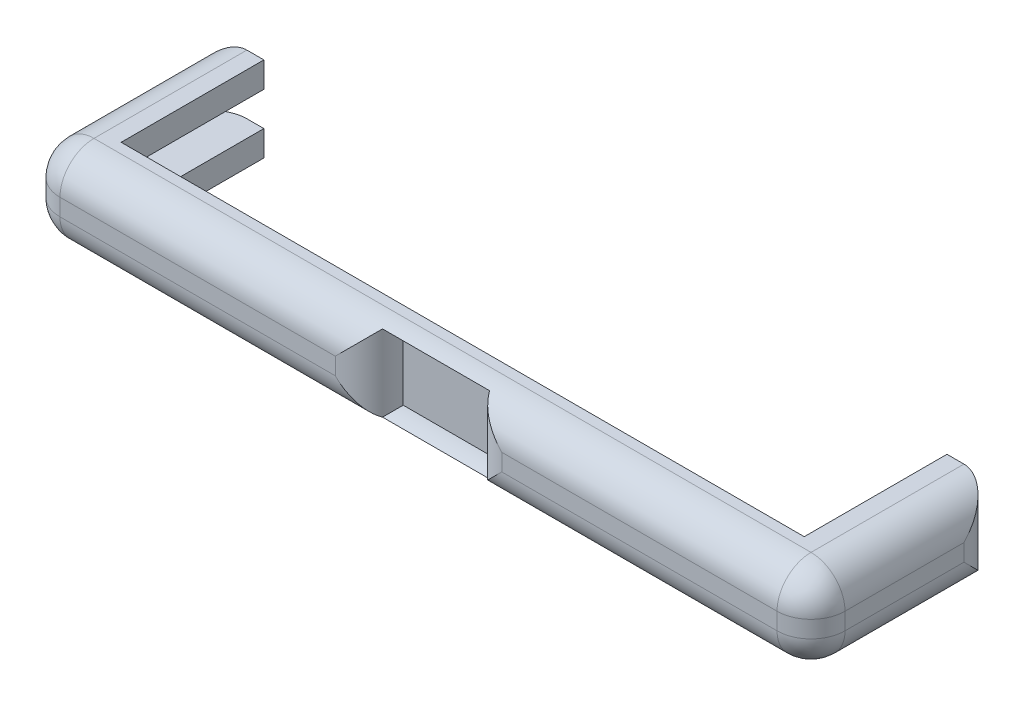
ISO-10303-21;
HEADER;
FILE_DESCRIPTION(('STEP AP214'),'2;1');
FILE_NAME('part.step','',(''),(''),'','','');
FILE_SCHEMA(('AUTOMOTIVE_DESIGN { 1 0 10303 214 1 1 1 1 }'));
ENDSEC;
DATA;
#1=APPLICATION_CONTEXT('core data for automotive mechanical design processes');
#2=APPLICATION_PROTOCOL_DEFINITION('international standard','automotive_design',2000,#1);
#3=PRODUCT_CONTEXT('',#1,'mechanical');
#4=PRODUCT('Part','Part','',(#3));
#5=PRODUCT_RELATED_PRODUCT_CATEGORY('part','',(#4));
#6=PRODUCT_DEFINITION_FORMATION('','',#4);
#7=PRODUCT_DEFINITION_CONTEXT('part definition',#1,'design');
#8=PRODUCT_DEFINITION('design','',#6,#7);
#9=PRODUCT_DEFINITION_SHAPE('','',#8);
#10=(LENGTH_UNIT() NAMED_UNIT(*) SI_UNIT(.MILLI.,.METRE.));
#11=(NAMED_UNIT(*) PLANE_ANGLE_UNIT() SI_UNIT($,.RADIAN.));
#12=(NAMED_UNIT(*) SI_UNIT($,.STERADIAN.) SOLID_ANGLE_UNIT());
#13=UNCERTAINTY_MEASURE_WITH_UNIT(LENGTH_MEASURE(1.E-05),#10,'distance_accuracy_value','');
#14=(GEOMETRIC_REPRESENTATION_CONTEXT(3) GLOBAL_UNCERTAINTY_ASSIGNED_CONTEXT((#13)) GLOBAL_UNIT_ASSIGNED_CONTEXT((#10,
#11,#12)) REPRESENTATION_CONTEXT('',''));
#15=CARTESIAN_POINT('',(0.,0.,0.));
#16=DIRECTION('',(0.,0.,1.));
#17=DIRECTION('',(1.,0.,0.));
#18=AXIS2_PLACEMENT_3D('',#15,#16,#17);
#19=CARTESIAN_POINT('',(0.,0.,-45.));
#20=DIRECTION('',(0.,0.,1.));
#21=DIRECTION('',(1.,0.,0.));
#22=AXIS2_PLACEMENT_3D('',#19,#20,#21);
#23=PLANE('',#22);
#24=DIRECTION('',(-1.,0.,0.));
#25=VECTOR('',#24,1.);
#26=CARTESIAN_POINT('',(0.,-21.3409125046628,-45.));
#27=LINE('',#26,#25);
#28=CARTESIAN_POINT('',(-63.7718582527357,-21.3409125046628,-45.));
#29=VERTEX_POINT('',#28);
#30=CARTESIAN_POINT('',(-68.7718582527357,-21.3409125046628,-45.));
#31=VERTEX_POINT('',#30);
#32=EDGE_CURVE('E472',#29,#31,#27,.T.);
#33=ORIENTED_EDGE('',*,*,#32,.T.);
#34=DIRECTION('',(0.,1.,0.));
#35=VECTOR('',#34,1.);
#36=CARTESIAN_POINT('',(-68.7718582527357,3.65908749533724,-45.));
#37=LINE('',#36,#35);
#38=CARTESIAN_POINT('',(-68.7718582527357,-13.8409125046628,-45.));
#39=VERTEX_POINT('',#38);
#40=EDGE_CURVE('E390',#31,#39,#37,.T.);
#41=ORIENTED_EDGE('',*,*,#40,.T.);
#42=DIRECTION('',(1.,0.,0.));
#43=VECTOR('',#42,1.);
#44=CARTESIAN_POINT('',(0.,-13.8409125046628,-45.));
#45=LINE('',#44,#43);
#46=CARTESIAN_POINT('',(-63.7718582527357,-13.8409125046628,-45.));
#47=VERTEX_POINT('',#46);
#48=EDGE_CURVE('E562',#39,#47,#45,.T.);
#49=ORIENTED_EDGE('',*,*,#48,.T.);
#50=DIRECTION('',(0.,-1.,0.));
#51=VECTOR('',#50,1.);
#52=CARTESIAN_POINT('',(-63.7718582527357,0.,-45.));
#53=LINE('',#52,#51);
#54=EDGE_CURVE('E476',#47,#29,#53,.T.);
#55=ORIENTED_EDGE('',*,*,#54,.T.);
#56=EDGE_LOOP('',(#33,#41,#49,#55));
#57=FACE_BOUND('',#56,.T.);
#58=ADVANCED_FACE('F37',(#57),#23,.F.);
#59=CARTESIAN_POINT('',(0.,0.,-45.));
#60=DIRECTION('',(0.,0.,1.));
#61=DIRECTION('',(1.,0.,0.));
#62=AXIS2_PLACEMENT_3D('',#59,#60,#61);
#63=PLANE('',#62);
#64=DIRECTION('',(-1.,0.,0.));
#65=VECTOR('',#64,1.);
#66=CARTESIAN_POINT('',(0.,3.65908749534074,-45.));
#67=LINE('',#66,#65);
#68=CARTESIAN_POINT('',(142.228141747265,3.65908749533747,-45.));
#69=VERTEX_POINT('',#68);
#70=CARTESIAN_POINT('',(137.228141747264,3.65908749533735,-45.));
#71=VERTEX_POINT('',#70);
#72=EDGE_CURVE('E503',#69,#71,#67,.T.);
#73=ORIENTED_EDGE('',*,*,#72,.F.);
#74=DIRECTION('',(0.,1.,0.));
#75=VECTOR('',#74,1.);
#76=CARTESIAN_POINT('',(142.228141747264,-21.3409125046627,-45.));
#77=LINE('',#76,#75);
#78=CARTESIAN_POINT('',(142.228141747264,-3.84091250466276,-45.));
#79=VERTEX_POINT('',#78);
#80=EDGE_CURVE('E356',#69,#79,#77,.F.);
#81=ORIENTED_EDGE('',*,*,#80,.T.);
#82=DIRECTION('',(1.,0.,0.));
#83=VECTOR('',#82,1.);
#84=CARTESIAN_POINT('',(0.,-3.84091250466276,-45.));
#85=LINE('',#84,#83);
#86=CARTESIAN_POINT('',(137.228141747264,-3.84091250466276,-45.));
#87=VERTEX_POINT('',#86);
#88=EDGE_CURVE('E508',#87,#79,#85,.T.);
#89=ORIENTED_EDGE('',*,*,#88,.F.);
#90=DIRECTION('',(0.,-1.,0.));
#91=VECTOR('',#90,1.);
#92=CARTESIAN_POINT('',(137.228141747264,0.,-45.));
#93=LINE('',#92,#91);
#94=EDGE_CURVE('E505',#71,#87,#93,.T.);
#95=ORIENTED_EDGE('',*,*,#94,.F.);
#96=EDGE_LOOP('',(#73,#81,#89,#95));
#97=FACE_BOUND('',#96,.T.);
#98=ADVANCED_FACE('F533',(#97),#63,.F.);
#99=CARTESIAN_POINT('',(0.,0.,10.));
#100=DIRECTION('',(0.,0.,1.));
#101=DIRECTION('',(1.,0.,0.));
#102=AXIS2_PLACEMENT_3D('',#99,#100,#101);
#103=PLANE('',#102);
#104=DIRECTION('',(0.,1.,0.));
#105=VECTOR('',#104,1.);
#106=CARTESIAN_POINT('',(12.2281417472643,1.15908749533726,10.));
#107=LINE('',#106,#105);
#108=CARTESIAN_POINT('',(12.2281417472643,-11.3409125046628,10.));
#109=VERTEX_POINT('',#108);
#110=CARTESIAN_POINT('',(12.2281417472643,-6.34091250465873,10.));
#111=VERTEX_POINT('',#110);
#112=EDGE_CURVE('E297',#109,#111,#107,.T.);
#113=ORIENTED_EDGE('',*,*,#112,.T.);
#114=DIRECTION('',(1.,0.,0.));
#115=VECTOR('',#114,1.);
#116=CARTESIAN_POINT('',(-1.45746419597552E-13,-6.34091250465926,10.));
#117=LINE('',#116,#115);
#118=CARTESIAN_POINT('',(-68.7718582527357,-6.34091250465768,10.));
#119=VERTEX_POINT('',#118);
#120=EDGE_CURVE('E300',#111,#119,#117,.F.);
#121=ORIENTED_EDGE('',*,*,#120,.T.);
#122=DIRECTION('',(0.,1.,0.));
#123=VECTOR('',#122,1.);
#124=CARTESIAN_POINT('',(-68.7718582527357,0.,10.));
#125=LINE('',#124,#123);
#126=CARTESIAN_POINT('',(-68.7718582527357,-11.3409125046628,10.));
#127=VERTEX_POINT('',#126);
#128=EDGE_CURVE('E294',#119,#127,#125,.F.);
#129=ORIENTED_EDGE('',*,*,#128,.T.);
#130=DIRECTION('',(1.,0.,0.));
#131=VECTOR('',#130,1.);
#132=CARTESIAN_POINT('',(0.,-11.3409125046628,10.));
#133=LINE('',#132,#131);
#134=EDGE_CURVE('E292',#127,#109,#133,.T.);
#135=ORIENTED_EDGE('',*,*,#134,.T.);
#136=EDGE_LOOP('',(#113,#121,#129,#135));
#137=FACE_BOUND('',#136,.T.);
#138=ADVANCED_FACE('F427',(#137),#103,.T.);
#139=CARTESIAN_POINT('',(137.228141747264,0.,-45.));
#140=DIRECTION('',(-1.,0.,0.));
#141=DIRECTION('',(0.,0.,1.));
#142=AXIS2_PLACEMENT_3D('',#139,#140,#141);
#143=PLANE('',#142);
#144=DIRECTION('',(0.,0.,1.));
#145=VECTOR('',#144,1.);
#146=CARTESIAN_POINT('',(137.228141747264,-21.3409125046627,-45.));
#147=LINE('',#146,#145);
#148=CARTESIAN_POINT('',(137.228141747264,-21.3409125046627,-45.));
#149=VERTEX_POINT('',#148);
#150=CARTESIAN_POINT('',(137.228141747264,-21.3409125046627,-3.));
#151=VERTEX_POINT('',#150);
#152=EDGE_CURVE('E239',#149,#151,#147,.T.);
#153=ORIENTED_EDGE('',*,*,#152,.T.);
#154=DIRECTION('',(0.,-1.,0.));
#155=VECTOR('',#154,1.);
#156=CARTESIAN_POINT('',(137.228141747264,0.,-3.));
#157=LINE('',#156,#155);
#158=CARTESIAN_POINT('',(137.228141747264,-13.8409125046628,-3.));
#159=VERTEX_POINT('',#158);
#160=EDGE_CURVE('E246',#159,#151,#157,.T.);
#161=ORIENTED_EDGE('',*,*,#160,.F.);
#162=DIRECTION('',(0.,0.,1.));
#163=VECTOR('',#162,1.);
#164=CARTESIAN_POINT('',(137.228141747264,-13.8409125046628,-45.));
#165=LINE('',#164,#163);
#166=CARTESIAN_POINT('',(137.228141747264,-13.8409125046628,-45.));
#167=VERTEX_POINT('',#166);
#168=EDGE_CURVE('E263',#167,#159,#165,.T.);
#169=ORIENTED_EDGE('',*,*,#168,.F.);
#170=DIRECTION('',(0.,-1.,0.));
#171=VECTOR('',#170,1.);
#172=CARTESIAN_POINT('',(137.228141747264,0.,-45.));
#173=LINE('',#172,#171);
#174=EDGE_CURVE('E260',#167,#149,#173,.T.);
#175=ORIENTED_EDGE('',*,*,#174,.T.);
#176=EDGE_LOOP('',(#153,#161,#169,#175));
#177=FACE_BOUND('',#176,.T.);
#178=ADVANCED_FACE('F258',(#177),#143,.T.);
#179=CARTESIAN_POINT('',(0.,-13.8409125046628,-45.));
#180=DIRECTION('',(0.,1.,0.));
#181=DIRECTION('',(0.,0.,1.));
#182=AXIS2_PLACEMENT_3D('',#179,#180,#181);
#183=PLANE('',#182);
#184=DIRECTION('',(0.,0.,1.));
#185=VECTOR('',#184,1.);
#186=CARTESIAN_POINT('',(147.228141747264,-13.8409125046628,-45.));
#187=LINE('',#186,#185);
#188=CARTESIAN_POINT('',(147.228141747264,-13.8409125046628,-43.6602540378444));
#189=VERTEX_POINT('',#188);
#190=CARTESIAN_POINT('',(147.228141747264,-13.8409125046628,-3.));
#191=VERTEX_POINT('',#190);
#192=EDGE_CURVE('E268',#189,#191,#187,.T.);
#193=ORIENTED_EDGE('',*,*,#192,.F.);
#194=CARTESIAN_POINT('',(142.228141747264,-13.8409125046628,-35.));
#195=DIRECTION('',(0.,1.,0.));
#196=DIRECTION('',(0.,0.,1.));
#197=AXIS2_PLACEMENT_3D('',#194,#195,#196);
#198=CIRCLE('',#197,10.);
#199=CARTESIAN_POINT('',(142.228141747264,-13.8409125046628,-45.));
#200=VERTEX_POINT('',#199);
#201=EDGE_CURVE('E362',#189,#200,#198,.T.);
#202=ORIENTED_EDGE('',*,*,#201,.T.);
#203=DIRECTION('',(-1.,0.,0.));
#204=VECTOR('',#203,1.);
#205=CARTESIAN_POINT('',(0.,-13.8409125046628,-45.));
#206=LINE('',#205,#204);
#207=EDGE_CURVE('E511',#200,#167,#206,.T.);
#208=ORIENTED_EDGE('',*,*,#207,.T.);
#209=ORIENTED_EDGE('',*,*,#168,.T.);
#210=DIRECTION('',(-1.,0.,0.));
#211=VECTOR('',#210,1.);
#212=CARTESIAN_POINT('',(0.,-13.8409125046628,-3.));
#213=LINE('',#212,#211);
#214=EDGE_CURVE('E253',#191,#159,#213,.T.);
#215=ORIENTED_EDGE('',*,*,#214,.F.);
#216=EDGE_LOOP('',(#193,#202,#208,#209,#215));
#217=FACE_BOUND('',#216,.T.);
#218=ADVANCED_FACE('F648',(#217),#183,.T.);
#219=CARTESIAN_POINT('',(147.228141747264,0.,-45.));
#220=DIRECTION('',(-1.,0.,0.));
#221=DIRECTION('',(0.,0.,1.));
#222=AXIS2_PLACEMENT_3D('',#219,#220,#221);
#223=PLANE('',#222);
#224=DIRECTION('',(0.,0.,1.));
#225=VECTOR('',#224,1.);
#226=CARTESIAN_POINT('',(147.228141747264,-3.84091250466276,-45.));
#227=LINE('',#226,#225);
#228=CARTESIAN_POINT('',(147.228141747264,-3.84091250466276,-43.6602540378444));
#229=VERTEX_POINT('',#228);
#230=CARTESIAN_POINT('',(147.228141747264,-3.84091250466276,-3.));
#231=VERTEX_POINT('',#230);
#232=EDGE_CURVE('E515',#229,#231,#227,.T.);
#233=ORIENTED_EDGE('',*,*,#232,.F.);
#234=DIRECTION('',(0.,-1.,0.));
#235=VECTOR('',#234,1.);
#236=CARTESIAN_POINT('',(147.228141747264,-3.84091250466276,-43.6602540378444));
#237=LINE('',#236,#235);
#238=EDGE_CURVE('E360',#229,#189,#237,.T.);
#239=ORIENTED_EDGE('',*,*,#238,.T.);
#240=ORIENTED_EDGE('',*,*,#192,.T.);
#241=DIRECTION('',(0.,-1.,0.));
#242=VECTOR('',#241,1.);
#243=CARTESIAN_POINT('',(147.228141747264,0.,-3.));
#244=LINE('',#243,#242);
#245=EDGE_CURVE('E545',#231,#191,#244,.T.);
#246=ORIENTED_EDGE('',*,*,#245,.F.);
#247=EDGE_LOOP('',(#233,#239,#240,#246));
#248=FACE_BOUND('',#247,.T.);
#249=ADVANCED_FACE('F543',(#248),#223,.T.);
#250=CARTESIAN_POINT('',(0.,-3.84091250466276,-45.));
#251=DIRECTION('',(0.,-1.,0.));
#252=DIRECTION('',(0.,0.,-1.));
#253=AXIS2_PLACEMENT_3D('',#250,#251,#252);
#254=PLANE('',#253);
#255=ORIENTED_EDGE('',*,*,#88,.T.);
#256=CARTESIAN_POINT('',(142.228141747264,-3.84091250466276,-35.));
#257=DIRECTION('',(0.,-1.,0.));
#258=DIRECTION('',(0.,0.,-1.));
#259=AXIS2_PLACEMENT_3D('',#256,#257,#258);
#260=CIRCLE('',#259,10.);
#261=EDGE_CURVE('E358',#79,#229,#260,.T.);
#262=ORIENTED_EDGE('',*,*,#261,.T.);
#263=ORIENTED_EDGE('',*,*,#232,.T.);
#264=DIRECTION('',(1.,0.,0.));
#265=VECTOR('',#264,1.);
#266=CARTESIAN_POINT('',(0.,-3.84091250466276,-3.));
#267=LINE('',#266,#265);
#268=CARTESIAN_POINT('',(137.228141747264,-3.84091250466276,-3.));
#269=VERTEX_POINT('',#268);
#270=EDGE_CURVE('E530',#269,#231,#267,.T.);
#271=ORIENTED_EDGE('',*,*,#270,.F.);
#272=DIRECTION('',(0.,0.,1.));
#273=VECTOR('',#272,1.);
#274=CARTESIAN_POINT('',(137.228141747264,-3.84091250466276,-45.));
#275=LINE('',#274,#273);
#276=EDGE_CURVE('E272',#87,#269,#275,.T.);
#277=ORIENTED_EDGE('',*,*,#276,.F.);
#278=EDGE_LOOP('',(#255,#262,#263,#271,#277));
#279=FACE_BOUND('',#278,.T.);
#280=ADVANCED_FACE('F528',(#279),#254,.T.);
#281=CARTESIAN_POINT('',(137.228141747264,0.,-45.));
#282=DIRECTION('',(-1.,0.,0.));
#283=DIRECTION('',(0.,0.,1.));
#284=AXIS2_PLACEMENT_3D('',#281,#282,#283);
#285=PLANE('',#284);
#286=ORIENTED_EDGE('',*,*,#276,.T.);
#287=DIRECTION('',(0.,-1.,0.));
#288=VECTOR('',#287,1.);
#289=CARTESIAN_POINT('',(137.228141747264,0.,-3.));
#290=LINE('',#289,#288);
#291=CARTESIAN_POINT('',(137.228141747264,3.65908749533735,-3.));
#292=VERTEX_POINT('',#291);
#293=EDGE_CURVE('E525',#292,#269,#290,.T.);
#294=ORIENTED_EDGE('',*,*,#293,.F.);
#295=DIRECTION('',(0.,0.,1.));
#296=VECTOR('',#295,1.);
#297=CARTESIAN_POINT('',(137.228141747264,3.65908749533735,-45.));
#298=LINE('',#297,#296);
#299=EDGE_CURVE('E276',#71,#292,#298,.T.);
#300=ORIENTED_EDGE('',*,*,#299,.F.);
#301=ORIENTED_EDGE('',*,*,#94,.T.);
#302=EDGE_LOOP('',(#286,#294,#300,#301));
#303=FACE_BOUND('',#302,.T.);
#304=ADVANCED_FACE('F523',(#303),#285,.T.);
#305=CARTESIAN_POINT('',(0.,-13.8409125046628,-45.));
#306=DIRECTION('',(0.,-1.,0.));
#307=DIRECTION('',(0.,0.,-1.));
#308=AXIS2_PLACEMENT_3D('',#305,#306,#307);
#309=PLANE('',#308);
#310=ORIENTED_EDGE('',*,*,#48,.F.);
#311=CARTESIAN_POINT('',(-68.7718582527357,-13.8409125046628,-35.));
#312=DIRECTION('',(0.,-1.,0.));
#313=DIRECTION('',(0.,0.,-1.));
#314=AXIS2_PLACEMENT_3D('',#311,#312,#313);
#315=CIRCLE('',#314,10.);
#316=CARTESIAN_POINT('',(-73.7718582527357,-13.8409125046628,-43.6602540378444));
#317=VERTEX_POINT('',#316);
#318=EDGE_CURVE('E392',#39,#317,#315,.F.);
#319=ORIENTED_EDGE('',*,*,#318,.T.);
#320=DIRECTION('',(0.,0.,1.));
#321=VECTOR('',#320,1.);
#322=CARTESIAN_POINT('',(-73.7718582527357,-13.8409125046628,-45.));
#323=LINE('',#322,#321);
#324=CARTESIAN_POINT('',(-73.7718582527357,-13.8409125046628,-3.00000000000002));
#325=VERTEX_POINT('',#324);
#326=EDGE_CURVE('E482',#317,#325,#323,.T.);
#327=ORIENTED_EDGE('',*,*,#326,.T.);
#328=DIRECTION('',(-1.,0.,0.));
#329=VECTOR('',#328,1.);
#330=CARTESIAN_POINT('',(0.,-13.8409125046628,-3.));
#331=LINE('',#330,#329);
#332=CARTESIAN_POINT('',(-63.7718582527357,-13.8409125046628,-3.));
#333=VERTEX_POINT('',#332);
#334=EDGE_CURVE('E557',#333,#325,#331,.T.);
#335=ORIENTED_EDGE('',*,*,#334,.F.);
#336=DIRECTION('',(0.,0.,1.));
#337=VECTOR('',#336,1.);
#338=CARTESIAN_POINT('',(-63.7718582527357,-13.8409125046628,-45.));
#339=LINE('',#338,#337);
#340=EDGE_CURVE('E483',#47,#333,#339,.T.);
#341=ORIENTED_EDGE('',*,*,#340,.F.);
#342=EDGE_LOOP('',(#310,#319,#327,#335,#341));
#343=FACE_BOUND('',#342,.T.);
#344=ADVANCED_FACE('F610',(#343),#309,.F.);
#345=CARTESIAN_POINT('',(-63.7718582527357,0.,-45.));
#346=DIRECTION('',(-1.,0.,0.));
#347=DIRECTION('',(0.,0.,1.));
#348=AXIS2_PLACEMENT_3D('',#345,#346,#347);
#349=PLANE('',#348);
#350=DIRECTION('',(0.,1.,0.));
#351=VECTOR('',#350,1.);
#352=CARTESIAN_POINT('',(-63.7718582527357,0.,-3.));
#353=LINE('',#352,#351);
#354=CARTESIAN_POINT('',(-63.7718582527357,-21.3409125046628,-3.));
#355=VERTEX_POINT('',#354);
#356=EDGE_CURVE('E560',#355,#333,#353,.T.);
#357=ORIENTED_EDGE('',*,*,#356,.F.);
#358=DIRECTION('',(0.,0.,1.));
#359=VECTOR('',#358,1.);
#360=CARTESIAN_POINT('',(-63.7718582527357,-21.3409125046628,-45.));
#361=LINE('',#360,#359);
#362=EDGE_CURVE('E243',#29,#355,#361,.T.);
#363=ORIENTED_EDGE('',*,*,#362,.F.);
#364=ORIENTED_EDGE('',*,*,#54,.F.);
#365=ORIENTED_EDGE('',*,*,#340,.T.);
#366=EDGE_LOOP('',(#357,#363,#364,#365));
#367=FACE_BOUND('',#366,.T.);
#368=ADVANCED_FACE('F616',(#367),#349,.F.);
#369=CARTESIAN_POINT('',(-63.7718582527357,0.,-45.));
#370=DIRECTION('',(1.,0.,0.));
#371=DIRECTION('',(0.,0.,-1.));
#372=AXIS2_PLACEMENT_3D('',#369,#370,#371);
#373=PLANE('',#372);
#374=DIRECTION('',(0.,0.,1.));
#375=VECTOR('',#374,1.);
#376=CARTESIAN_POINT('',(-63.7718582527357,3.65908749533724,-45.));
#377=LINE('',#376,#375);
#378=CARTESIAN_POINT('',(-63.7718582527357,3.65908749533724,-45.));
#379=VERTEX_POINT('',#378);
#380=CARTESIAN_POINT('',(-63.7718582527357,3.65908749533724,-3.));
#381=VERTEX_POINT('',#380);
#382=EDGE_CURVE('E470',#379,#381,#377,.T.);
#383=ORIENTED_EDGE('',*,*,#382,.T.);
#384=DIRECTION('',(0.,-1.,0.));
#385=VECTOR('',#384,1.);
#386=CARTESIAN_POINT('',(-63.7718582527357,0.,-3.));
#387=LINE('',#386,#385);
#388=CARTESIAN_POINT('',(-63.7718582527357,-3.84091250466276,-3.));
#389=VERTEX_POINT('',#388);
#390=EDGE_CURVE('E554',#381,#389,#387,.T.);
#391=ORIENTED_EDGE('',*,*,#390,.T.);
#392=DIRECTION('',(0.,0.,1.));
#393=VECTOR('',#392,1.);
#394=CARTESIAN_POINT('',(-63.7718582527357,-3.84091250466276,-45.));
#395=LINE('',#394,#393);
#396=CARTESIAN_POINT('',(-63.7718582527357,-3.84091250466276,-45.));
#397=VERTEX_POINT('',#396);
#398=EDGE_CURVE('E489',#397,#389,#395,.T.);
#399=ORIENTED_EDGE('',*,*,#398,.F.);
#400=DIRECTION('',(0.,1.,0.));
#401=VECTOR('',#400,1.);
#402=CARTESIAN_POINT('',(-63.7718582527357,0.,-45.));
#403=LINE('',#402,#401);
#404=EDGE_CURVE('E473',#397,#379,#403,.T.);
#405=ORIENTED_EDGE('',*,*,#404,.T.);
#406=EDGE_LOOP('',(#383,#391,#399,#405));
#407=FACE_BOUND('',#406,.T.);
#408=ADVANCED_FACE('F568',(#407),#373,.T.);
#409=CARTESIAN_POINT('',(0.,-3.84091250466276,-45.));
#410=DIRECTION('',(0.,-1.,0.));
#411=DIRECTION('',(0.,0.,-1.));
#412=AXIS2_PLACEMENT_3D('',#409,#410,#411);
#413=PLANE('',#412);
#414=DIRECTION('',(0.,0.,1.));
#415=VECTOR('',#414,1.);
#416=CARTESIAN_POINT('',(-73.7718582527357,-3.84091250466276,-45.));
#417=LINE('',#416,#415);
#418=CARTESIAN_POINT('',(-73.7718582527357,-3.84091250466276,-43.6602540378444));
#419=VERTEX_POINT('',#418);
#420=CARTESIAN_POINT('',(-73.7718582527357,-3.84091250466276,-3.));
#421=VERTEX_POINT('',#420);
#422=EDGE_CURVE('E492',#419,#421,#417,.T.);
#423=ORIENTED_EDGE('',*,*,#422,.F.);
#424=CARTESIAN_POINT('',(-68.7718582527357,-3.84091250466276,-35.));
#425=DIRECTION('',(0.,-1.,0.));
#426=DIRECTION('',(0.,0.,-1.));
#427=AXIS2_PLACEMENT_3D('',#424,#425,#426);
#428=CIRCLE('',#427,10.);
#429=CARTESIAN_POINT('',(-68.7718582527357,-3.84091250466276,-45.));
#430=VERTEX_POINT('',#429);
#431=EDGE_CURVE('E396',#419,#430,#428,.T.);
#432=ORIENTED_EDGE('',*,*,#431,.T.);
#433=DIRECTION('',(1.,0.,0.));
#434=VECTOR('',#433,1.);
#435=CARTESIAN_POINT('',(0.,-3.84091250466276,-45.));
#436=LINE('',#435,#434);
#437=EDGE_CURVE('E465',#430,#397,#436,.T.);
#438=ORIENTED_EDGE('',*,*,#437,.T.);
#439=ORIENTED_EDGE('',*,*,#398,.T.);
#440=DIRECTION('',(-1.,0.,0.));
#441=VECTOR('',#440,1.);
#442=CARTESIAN_POINT('',(0.,-3.84091250466276,-3.));
#443=LINE('',#442,#441);
#444=EDGE_CURVE('E551',#389,#421,#443,.T.);
#445=ORIENTED_EDGE('',*,*,#444,.T.);
#446=EDGE_LOOP('',(#423,#432,#438,#439,#445));
#447=FACE_BOUND('',#446,.T.);
#448=ADVANCED_FACE('F566',(#447),#413,.T.);
#449=CARTESIAN_POINT('',(-73.7718582527357,0.,-45.));
#450=DIRECTION('',(1.,0.,0.));
#451=DIRECTION('',(0.,0.,-1.));
#452=AXIS2_PLACEMENT_3D('',#449,#450,#451);
#453=PLANE('',#452);
#454=ORIENTED_EDGE('',*,*,#326,.F.);
#455=DIRECTION('',(0.,-1.,0.));
#456=VECTOR('',#455,1.);
#457=CARTESIAN_POINT('',(-73.7718582527357,-13.8409125046628,-43.6602540378444));
#458=LINE('',#457,#456);
#459=EDGE_CURVE('E394',#317,#419,#458,.F.);
#460=ORIENTED_EDGE('',*,*,#459,.T.);
#461=ORIENTED_EDGE('',*,*,#422,.T.);
#462=DIRECTION('',(0.,-1.,0.));
#463=VECTOR('',#462,1.);
#464=CARTESIAN_POINT('',(-73.7718582527357,0.,-3.));
#465=LINE('',#464,#463);
#466=EDGE_CURVE('E262',#421,#325,#465,.T.);
#467=ORIENTED_EDGE('',*,*,#466,.T.);
#468=EDGE_LOOP('',(#454,#460,#461,#467));
#469=FACE_BOUND('',#468,.T.);
#470=ADVANCED_FACE('F614',(#469),#453,.T.);
#471=CARTESIAN_POINT('',(152.228141747264,0.,-45.));
#472=DIRECTION('',(1.,0.,0.));
#473=DIRECTION('',(0.,0.,-1.));
#474=AXIS2_PLACEMENT_3D('',#471,#472,#473);
#475=PLANE('',#474);
#476=DIRECTION('',(0.,1.,0.));
#477=VECTOR('',#476,1.);
#478=CARTESIAN_POINT('',(152.228141747264,0.,0.));
#479=LINE('',#478,#477);
#480=CARTESIAN_POINT('',(152.228141747264,-6.34091250466253,0.));
#481=VERTEX_POINT('',#480);
#482=CARTESIAN_POINT('',(152.228141747264,-11.3409125046627,0.));
#483=VERTEX_POINT('',#482);
#484=EDGE_CURVE('E307',#481,#483,#479,.F.);
#485=ORIENTED_EDGE('',*,*,#484,.T.);
#486=DIRECTION('',(0.,0.,1.));
#487=VECTOR('',#486,1.);
#488=CARTESIAN_POINT('',(152.228141747264,-11.3409125046627,-45.));
#489=LINE('',#488,#487);
#490=CARTESIAN_POINT('',(152.228141747264,-11.3409125046627,-35.));
#491=VERTEX_POINT('',#490);
#492=EDGE_CURVE('E352',#483,#491,#489,.F.);
#493=ORIENTED_EDGE('',*,*,#492,.T.);
#494=DIRECTION('',(0.,1.,0.));
#495=VECTOR('',#494,1.);
#496=CARTESIAN_POINT('',(152.228141747264,3.65908749533724,-35.));
#497=LINE('',#496,#495);
#498=CARTESIAN_POINT('',(152.228141747264,-6.34091250466253,-35.));
#499=VERTEX_POINT('',#498);
#500=EDGE_CURVE('E350',#491,#499,#497,.T.);
#501=ORIENTED_EDGE('',*,*,#500,.T.);
#502=DIRECTION('',(0.,0.,1.));
#503=VECTOR('',#502,1.);
#504=CARTESIAN_POINT('',(152.228141747264,-6.34091250466253,-45.));
#505=LINE('',#504,#503);
#506=EDGE_CURVE('E348',#499,#481,#505,.T.);
#507=ORIENTED_EDGE('',*,*,#506,.T.);
#508=EDGE_LOOP('',(#485,#493,#501,#507));
#509=FACE_BOUND('',#508,.T.);
#510=ADVANCED_FACE('F578',(#509),#475,.T.);
#511=CARTESIAN_POINT('',(0.,-21.3409125046628,-45.));
#512=DIRECTION('',(0.,-1.,0.));
#513=DIRECTION('',(1.,0.,0.));
#514=AXIS2_PLACEMENT_3D('',#511,#512,#513);
#515=PLANE('',#514);
#516=DIRECTION('',(1.,0.,0.));
#517=VECTOR('',#516,1.);
#518=CARTESIAN_POINT('',(0.,-21.3409125046628,0.));
#519=LINE('',#518,#517);
#520=CARTESIAN_POINT('',(142.228141747264,-21.3409125046627,0.));
#521=VERTEX_POINT('',#520);
#522=CARTESIAN_POINT('',(-68.7718582527357,-21.3409125046628,0.));
#523=VERTEX_POINT('',#522);
#524=EDGE_CURVE('E310',#521,#523,#519,.F.);
#525=ORIENTED_EDGE('',*,*,#524,.T.);
#526=DIRECTION('',(0.,0.,-1.));
#527=VECTOR('',#526,1.);
#528=CARTESIAN_POINT('',(-68.7718582527357,-21.3409125046628,-45.));
#529=LINE('',#528,#527);
#530=EDGE_CURVE('E11',#523,#31,#529,.T.);
#531=ORIENTED_EDGE('',*,*,#530,.T.);
#532=ORIENTED_EDGE('',*,*,#32,.F.);
#533=ORIENTED_EDGE('',*,*,#362,.T.);
#534=DIRECTION('',(1.,0.,0.));
#535=VECTOR('',#534,1.);
#536=CARTESIAN_POINT('',(0.,-21.3409125046628,-3.));
#537=LINE('',#536,#535);
#538=EDGE_CURVE('E233',#355,#151,#537,.T.);
#539=ORIENTED_EDGE('',*,*,#538,.T.);
#540=ORIENTED_EDGE('',*,*,#152,.F.);
#541=DIRECTION('',(1.,0.,0.));
#542=VECTOR('',#541,1.);
#543=CARTESIAN_POINT('',(0.,-21.3409125046628,-45.));
#544=LINE('',#543,#542);
#545=CARTESIAN_POINT('',(142.228141747264,-21.3409125046627,-45.));
#546=VERTEX_POINT('',#545);
#547=EDGE_CURVE('E279',#149,#546,#544,.T.);
#548=ORIENTED_EDGE('',*,*,#547,.T.);
#549=DIRECTION('',(0.,0.,1.));
#550=VECTOR('',#549,1.);
#551=CARTESIAN_POINT('',(142.228141747264,-21.3409125046627,-45.));
#552=LINE('',#551,#550);
#553=EDGE_CURVE('E364',#546,#521,#552,.T.);
#554=ORIENTED_EDGE('',*,*,#553,.T.);
#555=EDGE_LOOP('',(#525,#531,#532,#533,#539,#540,#548,#554));
#556=FACE_BOUND('',#555,.T.);
#557=ADVANCED_FACE('F236',(#556),#515,.T.);
#558=CARTESIAN_POINT('',(0.,3.65908749534074,-45.));
#559=DIRECTION('',(0.,1.,0.));
#560=DIRECTION('',(-1.,0.,0.));
#561=AXIS2_PLACEMENT_3D('',#558,#559,#560);
#562=PLANE('',#561);
#563=DIRECTION('',(1.,0.,0.));
#564=VECTOR('',#563,1.);
#565=CARTESIAN_POINT('',(0.,3.65908749533728,-45.));
#566=LINE('',#565,#564);
#567=CARTESIAN_POINT('',(-68.7718582527354,3.65908749533724,-45.));
#568=VERTEX_POINT('',#567);
#569=EDGE_CURVE('E463',#568,#379,#566,.T.);
#570=ORIENTED_EDGE('',*,*,#569,.F.);
#571=DIRECTION('',(0.,0.,-1.));
#572=VECTOR('',#571,1.);
#573=CARTESIAN_POINT('',(-68.7718582527354,3.65908749534232,-45.));
#574=LINE('',#573,#572);
#575=CARTESIAN_POINT('',(-68.7718582527354,3.65908749534232,0.));
#576=VERTEX_POINT('',#575);
#577=EDGE_CURVE('E46',#568,#576,#574,.F.);
#578=ORIENTED_EDGE('',*,*,#577,.T.);
#579=DIRECTION('',(1.,0.,0.));
#580=VECTOR('',#579,1.);
#581=CARTESIAN_POINT('',(0.,3.65908749534074,0.));
#582=LINE('',#581,#580);
#583=CARTESIAN_POINT('',(142.228141747265,3.65908749533747,0.));
#584=VERTEX_POINT('',#583);
#585=EDGE_CURVE('E305',#576,#584,#582,.T.);
#586=ORIENTED_EDGE('',*,*,#585,.T.);
#587=DIRECTION('',(0.,0.,1.));
#588=VECTOR('',#587,1.);
#589=CARTESIAN_POINT('',(142.228141747265,3.65908749533747,-45.));
#590=LINE('',#589,#588);
#591=EDGE_CURVE('E366',#584,#69,#590,.F.);
#592=ORIENTED_EDGE('',*,*,#591,.T.);
#593=ORIENTED_EDGE('',*,*,#72,.T.);
#594=ORIENTED_EDGE('',*,*,#299,.T.);
#595=DIRECTION('',(1.,0.,0.));
#596=VECTOR('',#595,1.);
#597=CARTESIAN_POINT('',(0.,3.65908749533728,-3.));
#598=LINE('',#597,#596);
#599=EDGE_CURVE('E247',#381,#292,#598,.T.);
#600=ORIENTED_EDGE('',*,*,#599,.F.);
#601=ORIENTED_EDGE('',*,*,#382,.F.);
#602=EDGE_LOOP('',(#570,#578,#586,#592,#593,#594,#600,#601));
#603=FACE_BOUND('',#602,.T.);
#604=ADVANCED_FACE('F467',(#603),#562,.T.);
#605=ORIENTED_EDGE('',*,*,#207,.F.);
#606=DIRECTION('',(0.,1.,0.));
#607=VECTOR('',#606,1.);
#608=CARTESIAN_POINT('',(142.228141747264,-21.3409125046627,-45.));
#609=LINE('',#608,#607);
#610=EDGE_CURVE('E354',#200,#546,#609,.F.);
#611=ORIENTED_EDGE('',*,*,#610,.T.);
#612=ORIENTED_EDGE('',*,*,#547,.F.);
#613=ORIENTED_EDGE('',*,*,#174,.F.);
#614=EDGE_LOOP('',(#605,#611,#612,#613));
#615=FACE_BOUND('',#614,.T.);
#616=ADVANCED_FACE('F603',(#615),#63,.F.);
#617=CARTESIAN_POINT('',(-78.7718582527357,0.,10.));
#618=DIRECTION('',(-1.,0.,0.));
#619=DIRECTION('',(0.,0.,1.));
#620=AXIS2_PLACEMENT_3D('',#617,#618,#619);
#621=PLANE('',#620);
#622=DIRECTION('',(0.,1.,0.));
#623=VECTOR('',#622,1.);
#624=CARTESIAN_POINT('',(-78.7718582527357,0.,0.));
#625=LINE('',#624,#623);
#626=CARTESIAN_POINT('',(-78.7718582527357,-11.3409125046628,0.));
#627=VERTEX_POINT('',#626);
#628=CARTESIAN_POINT('',(-78.7718582527357,-6.34091250465768,0.));
#629=VERTEX_POINT('',#628);
#630=EDGE_CURVE('E303',#627,#629,#625,.T.);
#631=ORIENTED_EDGE('',*,*,#630,.T.);
#632=DIRECTION('',(0.,0.,-1.));
#633=VECTOR('',#632,1.);
#634=CARTESIAN_POINT('',(-78.7718582527357,-6.34091250465768,10.));
#635=LINE('',#634,#633);
#636=CARTESIAN_POINT('',(-78.7718582527357,-6.34091250465768,-35.));
#637=VERTEX_POINT('',#636);
#638=EDGE_CURVE('E54',#629,#637,#635,.T.);
#639=ORIENTED_EDGE('',*,*,#638,.T.);
#640=DIRECTION('',(0.,1.,0.));
#641=VECTOR('',#640,1.);
#642=CARTESIAN_POINT('',(-78.7718582527357,-21.3409125046628,-35.));
#643=LINE('',#642,#641);
#644=CARTESIAN_POINT('',(-78.7718582527357,-11.3409125046628,-35.));
#645=VERTEX_POINT('',#644);
#646=EDGE_CURVE('E58',#637,#645,#643,.F.);
#647=ORIENTED_EDGE('',*,*,#646,.T.);
#648=DIRECTION('',(0.,0.,-1.));
#649=VECTOR('',#648,1.);
#650=CARTESIAN_POINT('',(-78.7718582527357,-11.3409125046628,10.));
#651=LINE('',#650,#649);
#652=EDGE_CURVE('E398',#645,#627,#651,.F.);
#653=ORIENTED_EDGE('',*,*,#652,.T.);
#654=EDGE_LOOP('',(#631,#639,#647,#653));
#655=FACE_BOUND('',#654,.T.);
#656=ADVANCED_FACE('F449',(#655),#621,.T.);
#657=DIRECTION('',(1.,0.,0.));
#658=VECTOR('',#657,1.);
#659=CARTESIAN_POINT('',(-1.45746419597552E-13,-6.34091250465926,10.));
#660=LINE('',#659,#658);
#661=CARTESIAN_POINT('',(142.228141747264,-6.34091250466253,10.));
#662=VERTEX_POINT('',#661);
#663=CARTESIAN_POINT('',(61.2281417472643,-6.34091250466067,10.));
#664=VERTEX_POINT('',#663);
#665=EDGE_CURVE('E287',#662,#664,#660,.F.);
#666=ORIENTED_EDGE('',*,*,#665,.T.);
#667=DIRECTION('',(0.,1.,0.));
#668=VECTOR('',#667,1.);
#669=CARTESIAN_POINT('',(61.2281417472643,0.,10.));
#670=LINE('',#669,#668);
#671=CARTESIAN_POINT('',(61.2281417472643,-11.3409125046628,10.));
#672=VERTEX_POINT('',#671);
#673=EDGE_CURVE('E289',#664,#672,#670,.F.);
#674=ORIENTED_EDGE('',*,*,#673,.T.);
#675=DIRECTION('',(1.,0.,0.));
#676=VECTOR('',#675,1.);
#677=CARTESIAN_POINT('',(0.,-11.3409125046628,10.));
#678=LINE('',#677,#676);
#679=CARTESIAN_POINT('',(142.228141747264,-11.3409125046627,10.));
#680=VERTEX_POINT('',#679);
#681=EDGE_CURVE('E266',#672,#680,#678,.T.);
#682=ORIENTED_EDGE('',*,*,#681,.T.);
#683=DIRECTION('',(0.,1.,0.));
#684=VECTOR('',#683,1.);
#685=CARTESIAN_POINT('',(142.228141747264,0.,10.));
#686=LINE('',#685,#684);
#687=EDGE_CURVE('E284',#680,#662,#686,.T.);
#688=ORIENTED_EDGE('',*,*,#687,.T.);
#689=EDGE_LOOP('',(#666,#674,#682,#688));
#690=FACE_BOUND('',#689,.T.);
#691=ADVANCED_FACE('F590',(#690),#103,.T.);
#692=ORIENTED_EDGE('',*,*,#437,.F.);
#693=DIRECTION('',(0.,1.,0.));
#694=VECTOR('',#693,1.);
#695=CARTESIAN_POINT('',(-68.7718582527357,3.65908749533724,-45.));
#696=LINE('',#695,#694);
#697=EDGE_CURVE('E388',#430,#568,#696,.T.);
#698=ORIENTED_EDGE('',*,*,#697,.T.);
#699=ORIENTED_EDGE('',*,*,#569,.T.);
#700=ORIENTED_EDGE('',*,*,#404,.F.);
#701=EDGE_LOOP('',(#692,#698,#699,#700));
#702=FACE_BOUND('',#701,.T.);
#703=ADVANCED_FACE('F461',(#702),#23,.F.);
#704=CARTESIAN_POINT('',(0.,0.,-3.));
#705=DIRECTION('',(0.,0.,1.));
#706=DIRECTION('',(1.,0.,0.));
#707=AXIS2_PLACEMENT_3D('',#704,#705,#706);
#708=PLANE('',#707);
#709=ORIENTED_EDGE('',*,*,#538,.F.);
#710=ORIENTED_EDGE('',*,*,#356,.T.);
#711=ORIENTED_EDGE('',*,*,#334,.T.);
#712=ORIENTED_EDGE('',*,*,#466,.F.);
#713=ORIENTED_EDGE('',*,*,#444,.F.);
#714=ORIENTED_EDGE('',*,*,#390,.F.);
#715=ORIENTED_EDGE('',*,*,#599,.T.);
#716=ORIENTED_EDGE('',*,*,#293,.T.);
#717=ORIENTED_EDGE('',*,*,#270,.T.);
#718=ORIENTED_EDGE('',*,*,#245,.T.);
#719=ORIENTED_EDGE('',*,*,#214,.T.);
#720=ORIENTED_EDGE('',*,*,#160,.T.);
#721=EDGE_LOOP('',(#709,#710,#711,#712,#713,#714,#715,#716,#717,#718,#719,#720));
#722=FACE_BOUND('',#721,.T.);
#723=ADVANCED_FACE('F250',(#722),#708,.F.);
#724=CARTESIAN_POINT('',(0.,0.,0.));
#725=DIRECTION('',(0.,0.,1.));
#726=DIRECTION('',(1.,0.,0.));
#727=AXIS2_PLACEMENT_3D('',#724,#725,#726);
#728=PLANE('',#727);
#729=DIRECTION('',(1.,0.,0.));
#730=VECTOR('',#729,1.);
#731=CARTESIAN_POINT('',(0.,-18.8409125046628,0.));
#732=LINE('',#731,#730);
#733=CARTESIAN_POINT('',(22.2281417472643,-18.8409125046627,0.));
#734=VERTEX_POINT('',#733);
#735=CARTESIAN_POINT('',(51.2281417472643,-18.8409125046627,0.));
#736=VERTEX_POINT('',#735);
#737=EDGE_CURVE('E496',#734,#736,#732,.T.);
#738=ORIENTED_EDGE('',*,*,#737,.T.);
#739=DIRECTION('',(0.,1.,0.));
#740=VECTOR('',#739,1.);
#741=CARTESIAN_POINT('',(51.2281417472643,0.,0.));
#742=LINE('',#741,#740);
#743=CARTESIAN_POINT('',(51.2281417472643,1.15908749533726,0.));
#744=VERTEX_POINT('',#743);
#745=EDGE_CURVE('E486',#736,#744,#742,.T.);
#746=ORIENTED_EDGE('',*,*,#745,.T.);
#747=DIRECTION('',(1.,0.,0.));
#748=VECTOR('',#747,1.);
#749=CARTESIAN_POINT('',(0.,1.15908749533726,0.));
#750=LINE('',#749,#748);
#751=CARTESIAN_POINT('',(22.2281417472643,1.15908749533726,0.));
#752=VERTEX_POINT('',#751);
#753=EDGE_CURVE('E500',#752,#744,#750,.T.);
#754=ORIENTED_EDGE('',*,*,#753,.F.);
#755=DIRECTION('',(0.,1.,0.));
#756=VECTOR('',#755,1.);
#757=CARTESIAN_POINT('',(22.2281417472643,0.,0.));
#758=LINE('',#757,#756);
#759=EDGE_CURVE('E498',#734,#752,#758,.T.);
#760=ORIENTED_EDGE('',*,*,#759,.F.);
#761=EDGE_LOOP('',(#738,#746,#754,#760));
#762=FACE_BOUND('',#761,.T.);
#763=ADVANCED_FACE('F637',(#762),#728,.T.);
#764=CARTESIAN_POINT('',(-68.7718582527357,0.,0.));
#765=DIRECTION('',(0.,1.,0.));
#766=DIRECTION('',(0.,0.,1.));
#767=AXIS2_PLACEMENT_3D('',#764,#765,#766);
#768=CYLINDRICAL_SURFACE('',#767,10.);
#769=ORIENTED_EDGE('',*,*,#128,.F.);
#770=CARTESIAN_POINT('',(-68.7718582527357,-6.34091250465768,0.));
#771=DIRECTION('',(0.,1.,0.));
#772=DIRECTION('',(0.,0.,1.));
#773=AXIS2_PLACEMENT_3D('',#770,#771,#772);
#774=CIRCLE('',#773,10.);
#775=EDGE_CURVE('E384',#119,#629,#774,.F.);
#776=ORIENTED_EDGE('',*,*,#775,.T.);
#777=ORIENTED_EDGE('',*,*,#630,.F.);
#778=CARTESIAN_POINT('',(-68.7718582527357,-11.3409125046628,0.));
#779=DIRECTION('',(0.,1.,0.));
#780=DIRECTION('',(0.,0.,1.));
#781=AXIS2_PLACEMENT_3D('',#778,#779,#780);
#782=CIRCLE('',#781,10.);
#783=EDGE_CURVE('E382',#627,#127,#782,.T.);
#784=ORIENTED_EDGE('',*,*,#783,.T.);
#785=EDGE_LOOP('',(#769,#776,#777,#784));
#786=FACE_BOUND('',#785,.T.);
#787=ADVANCED_FACE('F424',(#786),#768,.T.);
#788=CARTESIAN_POINT('',(142.228141747264,0.,0.));
#789=DIRECTION('',(0.,1.,0.));
#790=DIRECTION('',(0.,0.,1.));
#791=AXIS2_PLACEMENT_3D('',#788,#789,#790);
#792=CYLINDRICAL_SURFACE('',#791,10.);
#793=ORIENTED_EDGE('',*,*,#687,.F.);
#794=CARTESIAN_POINT('',(142.228141747264,-11.3409125046627,0.));
#795=DIRECTION('',(0.,1.,0.));
#796=DIRECTION('',(0.,0.,1.));
#797=AXIS2_PLACEMENT_3D('',#794,#795,#796);
#798=CIRCLE('',#797,10.);
#799=EDGE_CURVE('E343',#680,#483,#798,.T.);
#800=ORIENTED_EDGE('',*,*,#799,.T.);
#801=ORIENTED_EDGE('',*,*,#484,.F.);
#802=CARTESIAN_POINT('',(142.228141747264,-6.34091250466253,0.));
#803=DIRECTION('',(0.,1.,0.));
#804=DIRECTION('',(0.,0.,1.));
#805=AXIS2_PLACEMENT_3D('',#802,#803,#804);
#806=CIRCLE('',#805,10.);
#807=EDGE_CURVE('E341',#481,#662,#806,.F.);
#808=ORIENTED_EDGE('',*,*,#807,.T.);
#809=EDGE_LOOP('',(#793,#800,#801,#808));
#810=FACE_BOUND('',#809,.T.);
#811=ADVANCED_FACE('F583',(#810),#792,.T.);
#812=CARTESIAN_POINT('',(0.,-11.3409125046628,0.));
#813=DIRECTION('',(1.,0.,0.));
#814=DIRECTION('',(0.,1.,0.));
#815=AXIS2_PLACEMENT_3D('',#812,#813,#814);
#816=CYLINDRICAL_SURFACE('',#815,10.);
#817=ORIENTED_EDGE('',*,*,#134,.F.);
#818=CARTESIAN_POINT('',(-68.7718582527357,-11.3409125046628,0.));
#819=DIRECTION('',(1.,0.,0.));
#820=DIRECTION('',(0.,1.,0.));
#821=AXIS2_PLACEMENT_3D('',#818,#819,#820);
#822=CIRCLE('',#821,10.);
#823=EDGE_CURVE('E386',#127,#523,#822,.T.);
#824=ORIENTED_EDGE('',*,*,#823,.T.);
#825=ORIENTED_EDGE('',*,*,#524,.F.);
#826=CARTESIAN_POINT('',(142.228141747264,-11.3409125046627,0.));
#827=DIRECTION('',(1.,0.,0.));
#828=DIRECTION('',(0.,1.,0.));
#829=AXIS2_PLACEMENT_3D('',#826,#827,#828);
#830=CIRCLE('',#829,10.);
#831=EDGE_CURVE('E312',#521,#680,#830,.F.);
#832=ORIENTED_EDGE('',*,*,#831,.T.);
#833=ORIENTED_EDGE('',*,*,#681,.F.);
#834=CARTESIAN_POINT('',(61.2281417472643,-11.3409125046628,0.));
#835=DIRECTION('',(-0.707106781186548,0.707106781186547,0.));
#836=DIRECTION('',(0.707106781186547,0.707106781186547,0.));
#837=AXIS2_PLACEMENT_3D('',#834,#835,#836);
#838=ELLIPSE('',#837,14.142135623731,10.);
#839=CARTESIAN_POINT('',(52.4781417472643,-20.0909125046627,4.84122918275928));
#840=VERTEX_POINT('',#839);
#841=EDGE_CURVE('E325',#840,#672,#838,.T.);
#842=ORIENTED_EDGE('',*,*,#841,.F.);
#843=DIRECTION('',(1.,0.,0.));
#844=VECTOR('',#843,1.);
#845=CARTESIAN_POINT('',(36.7281417472643,-20.0909125046627,4.84122918275928));
#846=LINE('',#845,#844);
#847=CARTESIAN_POINT('',(20.9781417472643,-20.0909125046628,4.84122918275928));
#848=VERTEX_POINT('',#847);
#849=EDGE_CURVE('E337',#848,#840,#846,.T.);
#850=ORIENTED_EDGE('',*,*,#849,.F.);
#851=CARTESIAN_POINT('',(12.2281417472643,-11.3409125046628,0.));
#852=DIRECTION('',(-0.707106781186547,-0.707106781186547,0.));
#853=DIRECTION('',(0.707106781186548,-0.707106781186547,0.));
#854=AXIS2_PLACEMENT_3D('',#851,#852,#853);
#855=ELLIPSE('',#854,14.1421356237309,10.);
#856=EDGE_CURVE('E331',#109,#848,#855,.F.);
#857=ORIENTED_EDGE('',*,*,#856,.F.);
#858=EDGE_LOOP('',(#817,#824,#825,#832,#833,#842,#850,#857));
#859=FACE_BOUND('',#858,.T.);
#860=ADVANCED_FACE('F430',(#859),#816,.T.);
#861=CARTESIAN_POINT('',(0.,-28.8409125046628,0.));
#862=DIRECTION('',(1.,0.,0.));
#863=DIRECTION('',(0.,1.,0.));
#864=AXIS2_PLACEMENT_3D('',#861,#862,#863);
#865=CYLINDRICAL_SURFACE('',#864,10.);
#866=CARTESIAN_POINT('',(61.2281417472643,-28.8409125046627,0.));
#867=DIRECTION('',(0.707106781186547,0.707106781186548,0.));
#868=DIRECTION('',(0.707106781186548,-0.707106781186547,0.));
#869=AXIS2_PLACEMENT_3D('',#866,#867,#868);
#870=ELLIPSE('',#869,14.1421356237309,10.);
#871=EDGE_CURVE('E322',#736,#840,#870,.T.);
#872=ORIENTED_EDGE('',*,*,#871,.F.);
#873=ORIENTED_EDGE('',*,*,#737,.F.);
#874=CARTESIAN_POINT('',(12.2281417472643,-28.8409125046628,0.));
#875=DIRECTION('',(0.707106781186548,-0.707106781186547,0.));
#876=DIRECTION('',(-0.707106781186547,-0.707106781186548,0.));
#877=AXIS2_PLACEMENT_3D('',#874,#875,#876);
#878=ELLIPSE('',#877,14.142135623731,10.);
#879=EDGE_CURVE('E334',#848,#734,#878,.F.);
#880=ORIENTED_EDGE('',*,*,#879,.F.);
#881=ORIENTED_EDGE('',*,*,#849,.T.);
#882=EDGE_LOOP('',(#872,#873,#880,#881));
#883=FACE_BOUND('',#882,.T.);
#884=ADVANCED_FACE('F679',(#883),#865,.T.);
#885=CARTESIAN_POINT('',(12.2281417472643,0.,0.));
#886=DIRECTION('',(0.,-1.,0.));
#887=DIRECTION('',(0.,0.,-1.));
#888=AXIS2_PLACEMENT_3D('',#885,#886,#887);
#889=CYLINDRICAL_SURFACE('',#888,10.);
#890=CARTESIAN_POINT('',(12.2281417472643,-6.34091250465954,0.));
#891=DIRECTION('',(0.707106781186539,-0.707106781186556,0.));
#892=DIRECTION('',(-0.707106781186556,-0.707106781186539,0.));
#893=AXIS2_PLACEMENT_3D('',#890,#891,#892);
#894=ELLIPSE('',#893,14.1421356237308,10.);
#895=CARTESIAN_POINT('',(20.9781417472628,2.40908749533876,4.84122918276198));
#896=VERTEX_POINT('',#895);
#897=EDGE_CURVE('E329',#111,#896,#894,.F.);
#898=ORIENTED_EDGE('',*,*,#897,.F.);
#899=ORIENTED_EDGE('',*,*,#112,.F.);
#900=ORIENTED_EDGE('',*,*,#856,.T.);
#901=ORIENTED_EDGE('',*,*,#879,.T.);
#902=ORIENTED_EDGE('',*,*,#759,.T.);
#903=CARTESIAN_POINT('',(12.2281417472643,11.1590874953373,0.));
#904=DIRECTION('',(-0.707106781186547,-0.707106781186547,0.));
#905=DIRECTION('',(-0.707106781186548,0.707106781186547,0.));
#906=AXIS2_PLACEMENT_3D('',#903,#904,#905);
#907=ELLIPSE('',#906,14.1421356237309,10.);
#908=EDGE_CURVE('E320',#896,#752,#907,.F.);
#909=ORIENTED_EDGE('',*,*,#908,.F.);
#910=EDGE_LOOP('',(#898,#899,#900,#901,#902,#909));
#911=FACE_BOUND('',#910,.T.);
#912=ADVANCED_FACE('F437',(#911),#889,.T.);
#913=CARTESIAN_POINT('',(-1.45746419597552E-13,-6.34091250465926,0.));
#914=DIRECTION('',(1.,0.,0.));
#915=DIRECTION('',(0.,1.,0.));
#916=AXIS2_PLACEMENT_3D('',#913,#914,#915);
#917=CYLINDRICAL_SURFACE('',#916,10.);
#918=ORIENTED_EDGE('',*,*,#585,.F.);
#919=CARTESIAN_POINT('',(-68.7718582527357,-6.34091250465768,0.));
#920=DIRECTION('',(1.,0.,0.));
#921=DIRECTION('',(0.,1.,0.));
#922=AXIS2_PLACEMENT_3D('',#919,#920,#921);
#923=CIRCLE('',#922,10.);
#924=EDGE_CURVE('E368',#576,#119,#923,.T.);
#925=ORIENTED_EDGE('',*,*,#924,.T.);
#926=ORIENTED_EDGE('',*,*,#120,.F.);
#927=ORIENTED_EDGE('',*,*,#897,.T.);
#928=DIRECTION('',(1.,0.,0.));
#929=VECTOR('',#928,1.);
#930=CARTESIAN_POINT('',(36.7281417472643,2.40908749533858,4.84122918276165));
#931=LINE('',#930,#929);
#932=CARTESIAN_POINT('',(52.4781417472655,2.40908749533844,4.8412291827614));
#933=VERTEX_POINT('',#932);
#934=EDGE_CURVE('E316',#933,#896,#931,.F.);
#935=ORIENTED_EDGE('',*,*,#934,.F.);
#936=CARTESIAN_POINT('',(61.2281417472643,-6.34091250466067,0.));
#937=DIRECTION('',(0.707106781186556,0.707106781186539,0.));
#938=DIRECTION('',(-0.707106781186539,0.707106781186556,0.));
#939=AXIS2_PLACEMENT_3D('',#936,#937,#938);
#940=ELLIPSE('',#939,14.1421356237311,10.);
#941=EDGE_CURVE('E327',#664,#933,#940,.F.);
#942=ORIENTED_EDGE('',*,*,#941,.F.);
#943=ORIENTED_EDGE('',*,*,#665,.F.);
#944=CARTESIAN_POINT('',(142.228141747264,-6.34091250466253,0.));
#945=DIRECTION('',(1.,0.,0.));
#946=DIRECTION('',(0.,1.,0.));
#947=AXIS2_PLACEMENT_3D('',#944,#945,#946);
#948=CIRCLE('',#947,10.);
#949=EDGE_CURVE('E345',#662,#584,#948,.F.);
#950=ORIENTED_EDGE('',*,*,#949,.T.);
#951=EDGE_LOOP('',(#918,#925,#926,#927,#935,#942,#943,#950));
#952=FACE_BOUND('',#951,.T.);
#953=ADVANCED_FACE('F443',(#952),#917,.T.);
#954=CARTESIAN_POINT('',(61.2281417472643,0.,0.));
#955=DIRECTION('',(0.,1.,0.));
#956=DIRECTION('',(0.,0.,1.));
#957=AXIS2_PLACEMENT_3D('',#954,#955,#956);
#958=CYLINDRICAL_SURFACE('',#957,10.);
#959=ORIENTED_EDGE('',*,*,#673,.F.);
#960=ORIENTED_EDGE('',*,*,#941,.T.);
#961=CARTESIAN_POINT('',(61.2281417472643,11.1590874953373,0.));
#962=DIRECTION('',(-0.707106781186548,0.707106781186547,0.));
#963=DIRECTION('',(-0.707106781186547,-0.707106781186547,0.));
#964=AXIS2_PLACEMENT_3D('',#961,#962,#963);
#965=ELLIPSE('',#964,14.142135623731,10.);
#966=EDGE_CURVE('E313',#744,#933,#965,.T.);
#967=ORIENTED_EDGE('',*,*,#966,.F.);
#968=ORIENTED_EDGE('',*,*,#745,.F.);
#969=ORIENTED_EDGE('',*,*,#871,.T.);
#970=ORIENTED_EDGE('',*,*,#841,.T.);
#971=EDGE_LOOP('',(#959,#960,#967,#968,#969,#970));
#972=FACE_BOUND('',#971,.T.);
#973=ADVANCED_FACE('F670',(#972),#958,.T.);
#974=CARTESIAN_POINT('',(0.,11.1590874953373,0.));
#975=DIRECTION('',(-1.,0.,0.));
#976=DIRECTION('',(0.,-1.,0.));
#977=AXIS2_PLACEMENT_3D('',#974,#975,#976);
#978=CYLINDRICAL_SURFACE('',#977,10.);
#979=ORIENTED_EDGE('',*,*,#908,.T.);
#980=ORIENTED_EDGE('',*,*,#753,.T.);
#981=ORIENTED_EDGE('',*,*,#966,.T.);
#982=ORIENTED_EDGE('',*,*,#934,.T.);
#983=EDGE_LOOP('',(#979,#980,#981,#982));
#984=FACE_BOUND('',#983,.T.);
#985=ADVANCED_FACE('F667',(#984),#978,.T.);
#986=CARTESIAN_POINT('',(142.228141747264,-6.34091250466253,0.));
#987=DIRECTION('',(0.,0.,1.));
#988=DIRECTION('',(1.,0.,0.));
#989=AXIS2_PLACEMENT_3D('',#986,#987,#988);
#990=SPHERICAL_SURFACE('',#989,10.);
#991=ORIENTED_EDGE('',*,*,#949,.F.);
#992=ORIENTED_EDGE('',*,*,#807,.F.);
#993=CARTESIAN_POINT('',(142.228141747264,-6.34091250466253,0.));
#994=DIRECTION('',(0.,0.,-1.));
#995=DIRECTION('',(-1.,0.,0.));
#996=AXIS2_PLACEMENT_3D('',#993,#994,#995);
#997=CIRCLE('',#996,10.);
#998=EDGE_CURVE('E317',#584,#481,#997,.T.);
#999=ORIENTED_EDGE('',*,*,#998,.F.);
#1000=EDGE_LOOP('',(#991,#992,#999));
#1001=FACE_BOUND('',#1000,.T.);
#1002=ADVANCED_FACE('F586',(#1001),#990,.T.);
#1003=CARTESIAN_POINT('',(142.228141747264,-6.34091250466253,-45.));
#1004=DIRECTION('',(0.,0.,1.));
#1005=DIRECTION('',(1.,0.,0.));
#1006=AXIS2_PLACEMENT_3D('',#1003,#1004,#1005);
#1007=CYLINDRICAL_SURFACE('',#1006,10.);
#1008=ORIENTED_EDGE('',*,*,#998,.T.);
#1009=ORIENTED_EDGE('',*,*,#506,.F.);
#1010=CARTESIAN_POINT('',(142.228141747264,-6.34091250466253,-35.));
#1011=DIRECTION('',(0.,0.707106781186547,0.707106781186547));
#1012=DIRECTION('',(0.,-0.707106781186547,0.707106781186547));
#1013=AXIS2_PLACEMENT_3D('',#1010,#1011,#1012);
#1014=ELLIPSE('',#1013,14.1421356237309,10.);
#1015=EDGE_CURVE('E375',#69,#499,#1014,.F.);
#1016=ORIENTED_EDGE('',*,*,#1015,.F.);
#1017=ORIENTED_EDGE('',*,*,#591,.F.);
#1018=EDGE_LOOP('',(#1008,#1009,#1016,#1017));
#1019=FACE_BOUND('',#1018,.T.);
#1020=ADVANCED_FACE('F573',(#1019),#1007,.T.);
#1021=CARTESIAN_POINT('',(142.228141747264,0.,-35.));
#1022=DIRECTION('',(0.,-1.,0.));
#1023=DIRECTION('',(0.,0.,-1.));
#1024=AXIS2_PLACEMENT_3D('',#1021,#1022,#1023);
#1025=CYLINDRICAL_SURFACE('',#1024,10.);
#1026=ORIENTED_EDGE('',*,*,#1015,.T.);
#1027=ORIENTED_EDGE('',*,*,#500,.F.);
#1028=CARTESIAN_POINT('',(142.228141747264,-11.3409125046627,-35.));
#1029=DIRECTION('',(0.,-0.707106781186547,0.707106781186547));
#1030=DIRECTION('',(0.,0.707106781186547,0.707106781186547));
#1031=AXIS2_PLACEMENT_3D('',#1028,#1029,#1030);
#1032=ELLIPSE('',#1031,14.1421356237309,10.);
#1033=EDGE_CURVE('E372',#546,#491,#1032,.T.);
#1034=ORIENTED_EDGE('',*,*,#1033,.F.);
#1035=ORIENTED_EDGE('',*,*,#610,.F.);
#1036=ORIENTED_EDGE('',*,*,#201,.F.);
#1037=ORIENTED_EDGE('',*,*,#238,.F.);
#1038=ORIENTED_EDGE('',*,*,#261,.F.);
#1039=ORIENTED_EDGE('',*,*,#80,.F.);
#1040=EDGE_LOOP('',(#1026,#1027,#1034,#1035,#1036,#1037,#1038,#1039));
#1041=FACE_BOUND('',#1040,.T.);
#1042=ADVANCED_FACE('F537',(#1041),#1025,.T.);
#1043=CARTESIAN_POINT('',(142.228141747264,-11.3409125046627,-45.));
#1044=DIRECTION('',(0.,0.,1.));
#1045=DIRECTION('',(1.,0.,0.));
#1046=AXIS2_PLACEMENT_3D('',#1043,#1044,#1045);
#1047=CYLINDRICAL_SURFACE('',#1046,10.);
#1048=ORIENTED_EDGE('',*,*,#1033,.T.);
#1049=ORIENTED_EDGE('',*,*,#492,.F.);
#1050=CARTESIAN_POINT('',(142.228141747264,-11.3409125046627,0.));
#1051=DIRECTION('',(0.,0.,1.));
#1052=DIRECTION('',(1.,0.,0.));
#1053=AXIS2_PLACEMENT_3D('',#1050,#1051,#1052);
#1054=CIRCLE('',#1053,10.);
#1055=EDGE_CURVE('E369',#521,#483,#1054,.T.);
#1056=ORIENTED_EDGE('',*,*,#1055,.F.);
#1057=ORIENTED_EDGE('',*,*,#553,.F.);
#1058=EDGE_LOOP('',(#1048,#1049,#1056,#1057));
#1059=FACE_BOUND('',#1058,.T.);
#1060=ADVANCED_FACE('F598',(#1059),#1047,.T.);
#1061=CARTESIAN_POINT('',(142.228141747264,-11.3409125046627,0.));
#1062=DIRECTION('',(0.,0.,1.));
#1063=DIRECTION('',(1.,0.,0.));
#1064=AXIS2_PLACEMENT_3D('',#1061,#1062,#1063);
#1065=SPHERICAL_SURFACE('',#1064,10.);
#1066=ORIENTED_EDGE('',*,*,#1055,.T.);
#1067=ORIENTED_EDGE('',*,*,#799,.F.);
#1068=ORIENTED_EDGE('',*,*,#831,.F.);
#1069=EDGE_LOOP('',(#1066,#1067,#1068));
#1070=FACE_BOUND('',#1069,.T.);
#1071=ADVANCED_FACE('F595',(#1070),#1065,.T.);
#1072=CARTESIAN_POINT('',(-68.7718582527357,-11.3409125046628,0.));
#1073=DIRECTION('',(0.,0.,1.));
#1074=DIRECTION('',(1.,0.,0.));
#1075=AXIS2_PLACEMENT_3D('',#1072,#1073,#1074);
#1076=SPHERICAL_SURFACE('',#1075,10.);
#1077=ORIENTED_EDGE('',*,*,#823,.F.);
#1078=ORIENTED_EDGE('',*,*,#783,.F.);
#1079=CARTESIAN_POINT('',(-68.7718582527357,-11.3409125046628,0.));
#1080=DIRECTION('',(0.,0.,-1.));
#1081=DIRECTION('',(-1.,0.,0.));
#1082=AXIS2_PLACEMENT_3D('',#1079,#1080,#1081);
#1083=CIRCLE('',#1082,10.);
#1084=EDGE_CURVE('E41',#523,#627,#1083,.T.);
#1085=ORIENTED_EDGE('',*,*,#1084,.F.);
#1086=EDGE_LOOP('',(#1077,#1078,#1085));
#1087=FACE_BOUND('',#1086,.T.);
#1088=ADVANCED_FACE('F39',(#1087),#1076,.T.);
#1089=CARTESIAN_POINT('',(-68.7718582527357,-11.3409125046628,-45.));
#1090=DIRECTION('',(0.,0.,-1.));
#1091=DIRECTION('',(-1.,0.,0.));
#1092=AXIS2_PLACEMENT_3D('',#1089,#1090,#1091);
#1093=CYLINDRICAL_SURFACE('',#1092,10.);
#1094=ORIENTED_EDGE('',*,*,#1084,.T.);
#1095=ORIENTED_EDGE('',*,*,#652,.F.);
#1096=CARTESIAN_POINT('',(-68.7718582527357,-11.3409125046628,-35.));
#1097=DIRECTION('',(0.,0.707106781186547,-0.707106781186547));
#1098=DIRECTION('',(0.,-0.707106781186547,-0.707106781186547));
#1099=AXIS2_PLACEMENT_3D('',#1096,#1097,#1098);
#1100=ELLIPSE('',#1099,14.1421356237309,10.);
#1101=EDGE_CURVE('E408',#31,#645,#1100,.T.);
#1102=ORIENTED_EDGE('',*,*,#1101,.F.);
#1103=ORIENTED_EDGE('',*,*,#530,.F.);
#1104=EDGE_LOOP('',(#1094,#1095,#1102,#1103));
#1105=FACE_BOUND('',#1104,.T.);
#1106=ADVANCED_FACE('F417',(#1105),#1093,.T.);
#1107=CARTESIAN_POINT('',(-68.7718582527357,0.,-35.));
#1108=DIRECTION('',(0.,-1.,0.));
#1109=DIRECTION('',(0.,0.,-1.));
#1110=AXIS2_PLACEMENT_3D('',#1107,#1108,#1109);
#1111=CYLINDRICAL_SURFACE('',#1110,10.);
#1112=ORIENTED_EDGE('',*,*,#1101,.T.);
#1113=ORIENTED_EDGE('',*,*,#646,.F.);
#1114=CARTESIAN_POINT('',(-68.7718582527357,-6.34091250465768,-35.));
#1115=DIRECTION('',(0.,-0.707106781186547,-0.707106781186547));
#1116=DIRECTION('',(0.,0.707106781186547,-0.707106781186547));
#1117=AXIS2_PLACEMENT_3D('',#1114,#1115,#1116);
#1118=ELLIPSE('',#1117,14.1421356237309,10.);
#1119=EDGE_CURVE('E406',#568,#637,#1118,.F.);
#1120=ORIENTED_EDGE('',*,*,#1119,.F.);
#1121=ORIENTED_EDGE('',*,*,#697,.F.);
#1122=ORIENTED_EDGE('',*,*,#431,.F.);
#1123=ORIENTED_EDGE('',*,*,#459,.F.);
#1124=ORIENTED_EDGE('',*,*,#318,.F.);
#1125=ORIENTED_EDGE('',*,*,#40,.F.);
#1126=EDGE_LOOP('',(#1112,#1113,#1120,#1121,#1122,#1123,#1124,#1125));
#1127=FACE_BOUND('',#1126,.T.);
#1128=ADVANCED_FACE('F455',(#1127),#1111,.T.);
#1129=CARTESIAN_POINT('',(-68.7718582527357,-6.34091250465768,10.));
#1130=DIRECTION('',(0.,0.,-1.));
#1131=DIRECTION('',(-1.,0.,0.));
#1132=AXIS2_PLACEMENT_3D('',#1129,#1130,#1131);
#1133=CYLINDRICAL_SURFACE('',#1132,10.);
#1134=ORIENTED_EDGE('',*,*,#1119,.T.);
#1135=ORIENTED_EDGE('',*,*,#638,.F.);
#1136=CARTESIAN_POINT('',(-68.7718582527357,-6.34091250465768,0.));
#1137=DIRECTION('',(0.,0.,1.));
#1138=DIRECTION('',(1.,0.,0.));
#1139=AXIS2_PLACEMENT_3D('',#1136,#1137,#1138);
#1140=CIRCLE('',#1139,10.);
#1141=EDGE_CURVE('E403',#576,#629,#1140,.T.);
#1142=ORIENTED_EDGE('',*,*,#1141,.F.);
#1143=ORIENTED_EDGE('',*,*,#577,.F.);
#1144=EDGE_LOOP('',(#1134,#1135,#1142,#1143));
#1145=FACE_BOUND('',#1144,.T.);
#1146=ADVANCED_FACE('F451',(#1145),#1133,.T.);
#1147=CARTESIAN_POINT('',(-68.7718582527357,-6.34091250465768,0.));
#1148=DIRECTION('',(0.,0.,1.));
#1149=DIRECTION('',(1.,0.,0.));
#1150=AXIS2_PLACEMENT_3D('',#1147,#1148,#1149);
#1151=SPHERICAL_SURFACE('',#1150,10.);
#1152=ORIENTED_EDGE('',*,*,#1141,.T.);
#1153=ORIENTED_EDGE('',*,*,#775,.F.);
#1154=ORIENTED_EDGE('',*,*,#924,.F.);
#1155=EDGE_LOOP('',(#1152,#1153,#1154));
#1156=FACE_BOUND('',#1155,.T.);
#1157=ADVANCED_FACE('F448',(#1156),#1151,.T.);
#1158=CLOSED_SHELL('',(#58,#98,#138,#178,#218,#249,#280,#304,#344,#368,#408,#448,#470,#510,#557,
#604,#616,#656,#691,#703,#723,#763,#787,#811,#860,#884,#912,#953,#973,#985,#1002,#1020,#1042,
#1060,#1071,#1088,#1106,#1128,#1146,#1157));
#1159=MANIFOLD_SOLID_BREP('B2',#1158);
#1160=ADVANCED_BREP_SHAPE_REPRESENTATION('',(#18,#1159),#14);
#1161=SHAPE_DEFINITION_REPRESENTATION(#9,#1160);
ENDSEC;
END-ISO-10303-21;
